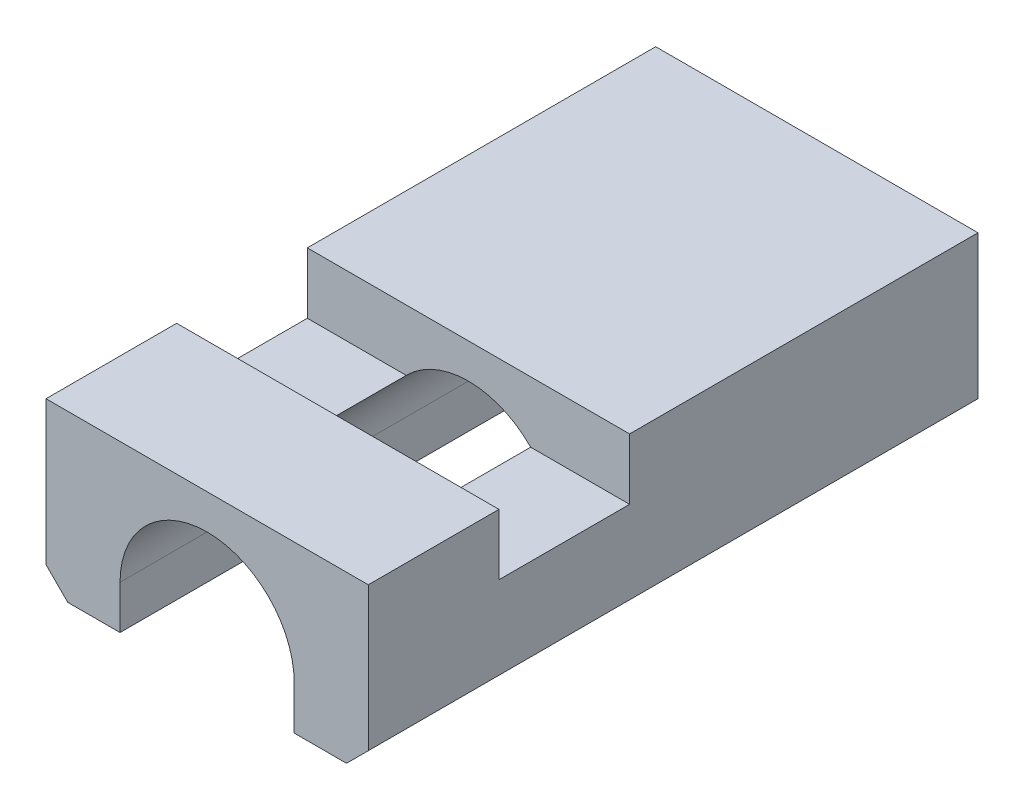
ISO-10303-21;
HEADER;
FILE_DESCRIPTION(('STEP AP214'),'2;1');
FILE_NAME('part.step','',(''),(''),'','','');
FILE_SCHEMA(('AUTOMOTIVE_DESIGN { 1 0 10303 214 1 1 1 1 }'));
ENDSEC;
DATA;
#1=APPLICATION_CONTEXT('core data for automotive mechanical design processes');
#2=APPLICATION_PROTOCOL_DEFINITION('international standard','automotive_design',2000,#1);
#3=PRODUCT_CONTEXT('',#1,'mechanical');
#4=PRODUCT('Part','Part','',(#3));
#5=PRODUCT_RELATED_PRODUCT_CATEGORY('part','',(#4));
#6=PRODUCT_DEFINITION_FORMATION('','',#4);
#7=PRODUCT_DEFINITION_CONTEXT('part definition',#1,'design');
#8=PRODUCT_DEFINITION('design','',#6,#7);
#9=PRODUCT_DEFINITION_SHAPE('','',#8);
#10=(LENGTH_UNIT() NAMED_UNIT(*) SI_UNIT(.MILLI.,.METRE.));
#11=(NAMED_UNIT(*) PLANE_ANGLE_UNIT() SI_UNIT($,.RADIAN.));
#12=(NAMED_UNIT(*) SI_UNIT($,.STERADIAN.) SOLID_ANGLE_UNIT());
#13=UNCERTAINTY_MEASURE_WITH_UNIT(LENGTH_MEASURE(1.E-05),#10,'distance_accuracy_value','');
#14=(GEOMETRIC_REPRESENTATION_CONTEXT(3) GLOBAL_UNCERTAINTY_ASSIGNED_CONTEXT((#13)) GLOBAL_UNIT_ASSIGNED_CONTEXT((#10,
#11,#12)) REPRESENTATION_CONTEXT('',''));
#15=CARTESIAN_POINT('',(0.,0.,0.));
#16=DIRECTION('',(0.,0.,1.));
#17=DIRECTION('',(1.,0.,0.));
#18=AXIS2_PLACEMENT_3D('',#15,#16,#17);
#19=CARTESIAN_POINT('',(-26.8712793989192,56.5488788418552,14.));
#20=DIRECTION('',(0.,-1.,0.));
#21=DIRECTION('',(0.,0.,-1.));
#22=AXIS2_PLACEMENT_3D('',#19,#20,#21);
#23=PLANE('',#22);
#24=DIRECTION('',(0.,0.,-1.));
#25=VECTOR('',#24,1.);
#26=CARTESIAN_POINT('',(-19.4712793989192,56.5488788418552,14.));
#27=LINE('',#26,#25);
#28=CARTESIAN_POINT('',(-19.4712793989192,56.5488788418552,14.));
#29=VERTEX_POINT('',#28);
#30=CARTESIAN_POINT('',(-19.4712793989192,56.5488788418552,11.));
#31=VERTEX_POINT('',#30);
#32=EDGE_CURVE('E237',#29,#31,#27,.T.);
#33=ORIENTED_EDGE('',*,*,#32,.T.);
#34=DIRECTION('',(1.,0.,0.));
#35=VECTOR('',#34,1.);
#36=CARTESIAN_POINT('',(-34.4712793989192,56.5488788418552,11.));
#37=LINE('',#36,#35);
#38=CARTESIAN_POINT('',(-26.8712793989192,56.5488788418552,11.));
#39=VERTEX_POINT('',#38);
#40=EDGE_CURVE('E165',#39,#31,#37,.T.);
#41=ORIENTED_EDGE('',*,*,#40,.F.);
#42=DIRECTION('',(0.,0.,-1.));
#43=VECTOR('',#42,1.);
#44=CARTESIAN_POINT('',(-26.8712793989192,56.5488788418552,14.));
#45=LINE('',#44,#43);
#46=CARTESIAN_POINT('',(-26.8712793989192,56.5488788418552,14.));
#47=VERTEX_POINT('',#46);
#48=EDGE_CURVE('E233',#47,#39,#45,.T.);
#49=ORIENTED_EDGE('',*,*,#48,.F.);
#50=DIRECTION('',(-1.,0.,0.));
#51=VECTOR('',#50,1.);
#52=CARTESIAN_POINT('',(-26.8712793989192,56.5488788418552,14.));
#53=LINE('',#52,#51);
#54=EDGE_CURVE('E203',#29,#47,#53,.T.);
#55=ORIENTED_EDGE('',*,*,#54,.F.);
#56=EDGE_LOOP('',(#33,#41,#49,#55));
#57=FACE_BOUND('',#56,.T.);
#58=ADVANCED_FACE('F35',(#57),#23,.F.);
#59=CARTESIAN_POINT('',(-25.1712793989192,52.7488788418552,14.));
#60=DIRECTION('',(-1.,0.,0.));
#61=DIRECTION('',(0.,-1.,0.));
#62=AXIS2_PLACEMENT_3D('',#59,#60,#61);
#63=PLANE('',#62);
#64=DIRECTION('',(0.,1.,0.));
#65=VECTOR('',#64,1.);
#66=CARTESIAN_POINT('',(-25.1712793989192,52.7488788418552,0.));
#67=LINE('',#66,#65);
#68=CARTESIAN_POINT('',(-25.1712793989192,52.7488788418552,0.));
#69=VERTEX_POINT('',#68);
#70=CARTESIAN_POINT('',(-25.1712793989192,53.7488788418552,0.));
#71=VERTEX_POINT('',#70);
#72=EDGE_CURVE('E189',#69,#71,#67,.T.);
#73=ORIENTED_EDGE('',*,*,#72,.T.);
#74=DIRECTION('',(0.,0.,-1.));
#75=VECTOR('',#74,1.);
#76=CARTESIAN_POINT('',(-25.1712793989192,53.7488788418552,14.));
#77=LINE('',#76,#75);
#78=CARTESIAN_POINT('',(-25.1712793989192,53.7488788418552,14.));
#79=VERTEX_POINT('',#78);
#80=EDGE_CURVE('E245',#79,#71,#77,.T.);
#81=ORIENTED_EDGE('',*,*,#80,.F.);
#82=DIRECTION('',(0.,1.,0.));
#83=VECTOR('',#82,1.);
#84=CARTESIAN_POINT('',(-25.1712793989192,52.7488788418552,14.));
#85=LINE('',#84,#83);
#86=CARTESIAN_POINT('',(-25.1712793989192,52.7488788418552,14.));
#87=VERTEX_POINT('',#86);
#88=EDGE_CURVE('E190',#87,#79,#85,.T.);
#89=ORIENTED_EDGE('',*,*,#88,.F.);
#90=DIRECTION('',(0.,0.,-1.));
#91=VECTOR('',#90,1.);
#92=CARTESIAN_POINT('',(-25.1712793989192,52.7488788418552,14.));
#93=LINE('',#92,#91);
#94=EDGE_CURVE('E210',#87,#69,#93,.T.);
#95=ORIENTED_EDGE('',*,*,#94,.T.);
#96=EDGE_LOOP('',(#73,#81,#89,#95));
#97=FACE_BOUND('',#96,.T.);
#98=ADVANCED_FACE('F296',(#97),#63,.F.);
#99=CARTESIAN_POINT('',(-23.1712793989192,53.7488788418552,14.));
#100=DIRECTION('',(0.,0.,-1.));
#101=DIRECTION('',(-1.,0.,0.));
#102=AXIS2_PLACEMENT_3D('',#99,#100,#101);
#103=CYLINDRICAL_SURFACE('',#102,2.);
#104=CARTESIAN_POINT('',(-23.1712793989192,53.7488788418552,8.));
#105=DIRECTION('',(0.,0.,-1.));
#106=DIRECTION('',(-1.,0.,0.));
#107=AXIS2_PLACEMENT_3D('',#104,#105,#106);
#108=CIRCLE('',#107,2.);
#109=CARTESIAN_POINT('',(-21.7429937132106,55.1488788418552,8.));
#110=VERTEX_POINT('',#109);
#111=CARTESIAN_POINT('',(-24.5995650846278,55.1488788418552,8.));
#112=VERTEX_POINT('',#111);
#113=EDGE_CURVE('E184',#110,#112,#108,.F.);
#114=ORIENTED_EDGE('',*,*,#113,.T.);
#115=DIRECTION('',(0.,0.,-1.));
#116=VECTOR('',#115,1.);
#117=CARTESIAN_POINT('',(-24.5995650846278,55.1488788418552,14.));
#118=LINE('',#117,#116);
#119=CARTESIAN_POINT('',(-24.5995650846278,55.1488788418552,11.));
#120=VERTEX_POINT('',#119);
#121=EDGE_CURVE('E181',#112,#120,#118,.F.);
#122=ORIENTED_EDGE('',*,*,#121,.T.);
#123=CARTESIAN_POINT('',(-23.1712793989192,53.7488788418552,11.));
#124=DIRECTION('',(0.,0.,1.));
#125=DIRECTION('',(0.,-1.,0.));
#126=AXIS2_PLACEMENT_3D('',#123,#124,#125);
#127=CIRCLE('',#126,2.);
#128=CARTESIAN_POINT('',(-21.7429937132106,55.1488788418552,11.));
#129=VERTEX_POINT('',#128);
#130=EDGE_CURVE('E187',#120,#129,#127,.F.);
#131=ORIENTED_EDGE('',*,*,#130,.T.);
#132=DIRECTION('',(0.,0.,-1.));
#133=VECTOR('',#132,1.);
#134=CARTESIAN_POINT('',(-21.7429937132106,55.1488788418552,14.));
#135=LINE('',#134,#133);
#136=EDGE_CURVE('E154',#129,#110,#135,.T.);
#137=ORIENTED_EDGE('',*,*,#136,.T.);
#138=EDGE_LOOP('',(#114,#122,#131,#137));
#139=FACE_BOUND('',#138,.T.);
#140=CARTESIAN_POINT('',(-23.1712793989192,53.7488788418552,0.));
#141=DIRECTION('',(0.,0.,-1.));
#142=DIRECTION('',(-1.,0.,0.));
#143=AXIS2_PLACEMENT_3D('',#140,#141,#142);
#144=CIRCLE('',#143,2.);
#145=CARTESIAN_POINT('',(-21.1712793989192,53.7488788418552,0.));
#146=VERTEX_POINT('',#145);
#147=EDGE_CURVE('E213',#71,#146,#144,.T.);
#148=ORIENTED_EDGE('',*,*,#147,.T.);
#149=DIRECTION('',(0.,0.,-1.));
#150=VECTOR('',#149,1.);
#151=CARTESIAN_POINT('',(-21.1712793989192,53.7488788418552,14.));
#152=LINE('',#151,#150);
#153=CARTESIAN_POINT('',(-21.1712793989192,53.7488788418552,14.));
#154=VERTEX_POINT('',#153);
#155=EDGE_CURVE('E242',#154,#146,#152,.T.);
#156=ORIENTED_EDGE('',*,*,#155,.F.);
#157=CARTESIAN_POINT('',(-23.1712793989192,53.7488788418552,14.));
#158=DIRECTION('',(0.,0.,-1.));
#159=DIRECTION('',(-1.,0.,0.));
#160=AXIS2_PLACEMENT_3D('',#157,#158,#159);
#161=CIRCLE('',#160,2.);
#162=EDGE_CURVE('E193',#79,#154,#161,.T.);
#163=ORIENTED_EDGE('',*,*,#162,.F.);
#164=ORIENTED_EDGE('',*,*,#80,.T.);
#165=EDGE_LOOP('',(#148,#156,#163,#164));
#166=FACE_BOUND('',#165,.T.);
#167=ADVANCED_FACE('F301',(#139,#166),#103,.F.);
#168=CARTESIAN_POINT('',(-21.1712793989192,53.7488788418552,14.));
#169=DIRECTION('',(1.,0.,0.));
#170=DIRECTION('',(0.,1.,0.));
#171=AXIS2_PLACEMENT_3D('',#168,#169,#170);
#172=PLANE('',#171);
#173=DIRECTION('',(0.,-1.,0.));
#174=VECTOR('',#173,1.);
#175=CARTESIAN_POINT('',(-21.1712793989192,53.7488788418552,0.));
#176=LINE('',#175,#174);
#177=CARTESIAN_POINT('',(-21.1712793989192,52.7488788418552,0.));
#178=VERTEX_POINT('',#177);
#179=EDGE_CURVE('E215',#146,#178,#176,.T.);
#180=ORIENTED_EDGE('',*,*,#179,.T.);
#181=DIRECTION('',(0.,0.,-1.));
#182=VECTOR('',#181,1.);
#183=CARTESIAN_POINT('',(-21.1712793989192,52.7488788418552,14.));
#184=LINE('',#183,#182);
#185=CARTESIAN_POINT('',(-21.1712793989192,52.7488788418552,14.));
#186=VERTEX_POINT('',#185);
#187=EDGE_CURVE('E239',#186,#178,#184,.T.);
#188=ORIENTED_EDGE('',*,*,#187,.F.);
#189=DIRECTION('',(0.,-1.,0.));
#190=VECTOR('',#189,1.);
#191=CARTESIAN_POINT('',(-21.1712793989192,53.7488788418552,14.));
#192=LINE('',#191,#190);
#193=EDGE_CURVE('E196',#154,#186,#192,.T.);
#194=ORIENTED_EDGE('',*,*,#193,.F.);
#195=ORIENTED_EDGE('',*,*,#155,.T.);
#196=EDGE_LOOP('',(#180,#188,#194,#195));
#197=FACE_BOUND('',#196,.T.);
#198=ADVANCED_FACE('F304',(#197),#172,.F.);
#199=CARTESIAN_POINT('',(-21.1712793989192,52.7488788418552,14.));
#200=DIRECTION('',(0.,1.,0.));
#201=DIRECTION('',(-1.,0.,0.));
#202=AXIS2_PLACEMENT_3D('',#199,#200,#201);
#203=PLANE('',#202);
#204=DIRECTION('',(1.,0.,0.));
#205=VECTOR('',#204,1.);
#206=CARTESIAN_POINT('',(-21.1712793989192,52.7488788418552,0.));
#207=LINE('',#206,#205);
#208=CARTESIAN_POINT('',(-19.9712793989192,52.7488788418552,0.));
#209=VERTEX_POINT('',#208);
#210=EDGE_CURVE('E217',#178,#209,#207,.T.);
#211=ORIENTED_EDGE('',*,*,#210,.T.);
#212=DIRECTION('',(0.,0.,1.));
#213=VECTOR('',#212,1.);
#214=CARTESIAN_POINT('',(-19.9712793989192,52.7488788418552,14.));
#215=LINE('',#214,#213);
#216=CARTESIAN_POINT('',(-19.9712793989192,52.7488788418552,14.));
#217=VERTEX_POINT('',#216);
#218=EDGE_CURVE('E255',#209,#217,#215,.T.);
#219=ORIENTED_EDGE('',*,*,#218,.T.);
#220=DIRECTION('',(1.,0.,0.));
#221=VECTOR('',#220,1.);
#222=CARTESIAN_POINT('',(-21.1712793989192,52.7488788418552,14.));
#223=LINE('',#222,#221);
#224=EDGE_CURVE('E198',#186,#217,#223,.T.);
#225=ORIENTED_EDGE('',*,*,#224,.F.);
#226=ORIENTED_EDGE('',*,*,#187,.T.);
#227=EDGE_LOOP('',(#211,#219,#225,#226));
#228=FACE_BOUND('',#227,.T.);
#229=ADVANCED_FACE('F308',(#228),#203,.F.);
#230=CARTESIAN_POINT('',(-19.4712793989192,53.7488788418552,14.));
#231=DIRECTION('',(-1.,0.,0.));
#232=DIRECTION('',(0.,0.,1.));
#233=AXIS2_PLACEMENT_3D('',#230,#231,#232);
#234=PLANE('',#233);
#235=DIRECTION('',(0.,0.,-1.));
#236=VECTOR('',#235,1.);
#237=CARTESIAN_POINT('',(-19.4712793989192,55.1488788418552,11.));
#238=LINE('',#237,#236);
#239=CARTESIAN_POINT('',(-19.4712793989192,55.1488788418552,11.));
#240=VERTEX_POINT('',#239);
#241=CARTESIAN_POINT('',(-19.4712793989192,55.1488788418552,8.));
#242=VERTEX_POINT('',#241);
#243=EDGE_CURVE('E151',#240,#242,#238,.T.);
#244=ORIENTED_EDGE('',*,*,#243,.F.);
#245=DIRECTION('',(0.,-1.,0.));
#246=VECTOR('',#245,1.);
#247=CARTESIAN_POINT('',(-19.4712793989192,56.5488788418552,11.));
#248=LINE('',#247,#246);
#249=EDGE_CURVE('E161',#31,#240,#248,.T.);
#250=ORIENTED_EDGE('',*,*,#249,.F.);
#251=ORIENTED_EDGE('',*,*,#32,.F.);
#252=DIRECTION('',(0.,1.,0.));
#253=VECTOR('',#252,1.);
#254=CARTESIAN_POINT('',(-19.4712793989192,52.7488788418552,14.));
#255=LINE('',#254,#253);
#256=CARTESIAN_POINT('',(-19.4712793989192,53.2488788418552,14.));
#257=VERTEX_POINT('',#256);
#258=EDGE_CURVE('E201',#257,#29,#255,.T.);
#259=ORIENTED_EDGE('',*,*,#258,.F.);
#260=DIRECTION('',(0.,0.,-1.));
#261=VECTOR('',#260,1.);
#262=CARTESIAN_POINT('',(-19.4712793989192,53.2488788418552,14.));
#263=LINE('',#262,#261);
#264=CARTESIAN_POINT('',(-19.4712793989192,53.2488788418552,0.));
#265=VERTEX_POINT('',#264);
#266=EDGE_CURVE('E248',#257,#265,#263,.T.);
#267=ORIENTED_EDGE('',*,*,#266,.T.);
#268=DIRECTION('',(0.,1.,0.));
#269=VECTOR('',#268,1.);
#270=CARTESIAN_POINT('',(-19.4712793989192,53.7488788418552,0.));
#271=LINE('',#270,#269);
#272=CARTESIAN_POINT('',(-19.4712793989192,56.5488788418552,0.));
#273=VERTEX_POINT('',#272);
#274=EDGE_CURVE('E220',#265,#273,#271,.T.);
#275=ORIENTED_EDGE('',*,*,#274,.T.);
#276=CARTESIAN_POINT('',(-19.4712793989192,56.5488788418552,8.));
#277=VERTEX_POINT('',#276);
#278=EDGE_CURVE('E236',#277,#273,#27,.T.);
#279=ORIENTED_EDGE('',*,*,#278,.F.);
#280=DIRECTION('',(0.,1.,0.));
#281=VECTOR('',#280,1.);
#282=CARTESIAN_POINT('',(-19.4712793989192,56.5488788418552,8.));
#283=LINE('',#282,#281);
#284=EDGE_CURVE('E158',#242,#277,#283,.T.);
#285=ORIENTED_EDGE('',*,*,#284,.F.);
#286=EDGE_LOOP('',(#244,#250,#251,#259,#267,#275,#279,#285));
#287=FACE_BOUND('',#286,.T.);
#288=ADVANCED_FACE('F170',(#287),#234,.F.);
#289=CARTESIAN_POINT('',(-26.8712793989192,56.5488788418552,8.));
#290=VERTEX_POINT('',#289);
#291=CARTESIAN_POINT('',(-26.8712793989192,56.5488788418552,0.));
#292=VERTEX_POINT('',#291);
#293=EDGE_CURVE('E232',#290,#292,#45,.T.);
#294=ORIENTED_EDGE('',*,*,#293,.F.);
#295=DIRECTION('',(1.,0.,0.));
#296=VECTOR('',#295,1.);
#297=CARTESIAN_POINT('',(-34.4712793989192,56.5488788418552,8.));
#298=LINE('',#297,#296);
#299=EDGE_CURVE('E176',#290,#277,#298,.T.);
#300=ORIENTED_EDGE('',*,*,#299,.T.);
#301=ORIENTED_EDGE('',*,*,#278,.T.);
#302=DIRECTION('',(-1.,0.,0.));
#303=VECTOR('',#302,1.);
#304=CARTESIAN_POINT('',(-26.8712793989192,56.5488788418552,0.));
#305=LINE('',#304,#303);
#306=EDGE_CURVE('E223',#273,#292,#305,.T.);
#307=ORIENTED_EDGE('',*,*,#306,.T.);
#308=EDGE_LOOP('',(#294,#300,#301,#307));
#309=FACE_BOUND('',#308,.T.);
#310=ADVANCED_FACE('F275',(#309),#23,.F.);
#311=CARTESIAN_POINT('',(-26.8712793989192,53.7488788418552,14.));
#312=DIRECTION('',(1.,0.,0.));
#313=DIRECTION('',(0.,0.,-1.));
#314=AXIS2_PLACEMENT_3D('',#311,#312,#313);
#315=PLANE('',#314);
#316=ORIENTED_EDGE('',*,*,#48,.T.);
#317=DIRECTION('',(0.,-1.,0.));
#318=VECTOR('',#317,1.);
#319=CARTESIAN_POINT('',(-26.8712793989192,53.7488788418552,11.));
#320=LINE('',#319,#318);
#321=CARTESIAN_POINT('',(-26.8712793989192,55.1488788418552,11.));
#322=VERTEX_POINT('',#321);
#323=EDGE_CURVE('E11',#39,#322,#320,.T.);
#324=ORIENTED_EDGE('',*,*,#323,.T.);
#325=DIRECTION('',(0.,0.,-1.));
#326=VECTOR('',#325,1.);
#327=CARTESIAN_POINT('',(-26.8712793989192,55.1488788418552,14.));
#328=LINE('',#327,#326);
#329=CARTESIAN_POINT('',(-26.8712793989192,55.1488788418552,8.));
#330=VERTEX_POINT('',#329);
#331=EDGE_CURVE('E266',#322,#330,#328,.T.);
#332=ORIENTED_EDGE('',*,*,#331,.T.);
#333=DIRECTION('',(0.,1.,0.));
#334=VECTOR('',#333,1.);
#335=CARTESIAN_POINT('',(-26.8712793989192,53.7488788418552,8.));
#336=LINE('',#335,#334);
#337=EDGE_CURVE('E44',#330,#290,#336,.T.);
#338=ORIENTED_EDGE('',*,*,#337,.T.);
#339=ORIENTED_EDGE('',*,*,#293,.T.);
#340=DIRECTION('',(0.,-1.,0.));
#341=VECTOR('',#340,1.);
#342=CARTESIAN_POINT('',(-26.8712793989192,53.7488788418552,0.));
#343=LINE('',#342,#341);
#344=CARTESIAN_POINT('',(-26.8712793989192,53.2488788418552,0.));
#345=VERTEX_POINT('',#344);
#346=EDGE_CURVE('E226',#292,#345,#343,.T.);
#347=ORIENTED_EDGE('',*,*,#346,.T.);
#348=DIRECTION('',(0.,0.,1.));
#349=VECTOR('',#348,1.);
#350=CARTESIAN_POINT('',(-26.8712793989192,53.2488788418552,14.));
#351=LINE('',#350,#349);
#352=CARTESIAN_POINT('',(-26.8712793989192,53.2488788418552,14.));
#353=VERTEX_POINT('',#352);
#354=EDGE_CURVE('E264',#345,#353,#351,.T.);
#355=ORIENTED_EDGE('',*,*,#354,.T.);
#356=DIRECTION('',(0.,-1.,0.));
#357=VECTOR('',#356,1.);
#358=CARTESIAN_POINT('',(-26.8712793989192,53.7488788418552,14.));
#359=LINE('',#358,#357);
#360=EDGE_CURVE('E205',#47,#353,#359,.T.);
#361=ORIENTED_EDGE('',*,*,#360,.F.);
#362=EDGE_LOOP('',(#316,#324,#332,#338,#339,#347,#355,#361));
#363=FACE_BOUND('',#362,.T.);
#364=ADVANCED_FACE('F271',(#363),#315,.F.);
#365=CARTESIAN_POINT('',(-26.8712793989192,52.7488788418552,14.));
#366=DIRECTION('',(0.,1.,0.));
#367=DIRECTION('',(0.,0.,1.));
#368=AXIS2_PLACEMENT_3D('',#365,#366,#367);
#369=PLANE('',#368);
#370=DIRECTION('',(1.,0.,0.));
#371=VECTOR('',#370,1.);
#372=CARTESIAN_POINT('',(-26.8712793989192,52.7488788418552,14.));
#373=LINE('',#372,#371);
#374=CARTESIAN_POINT('',(-26.3712793989192,52.7488788418552,14.));
#375=VERTEX_POINT('',#374);
#376=EDGE_CURVE('E208',#375,#87,#373,.T.);
#377=ORIENTED_EDGE('',*,*,#376,.F.);
#378=DIRECTION('',(0.,0.,-1.));
#379=VECTOR('',#378,1.);
#380=CARTESIAN_POINT('',(-26.3712793989192,52.7488788418552,14.));
#381=LINE('',#380,#379);
#382=CARTESIAN_POINT('',(-26.3712793989192,52.7488788418552,0.));
#383=VERTEX_POINT('',#382);
#384=EDGE_CURVE('E261',#375,#383,#381,.T.);
#385=ORIENTED_EDGE('',*,*,#384,.T.);
#386=DIRECTION('',(1.,0.,0.));
#387=VECTOR('',#386,1.);
#388=CARTESIAN_POINT('',(-26.8712793989192,52.7488788418552,0.));
#389=LINE('',#388,#387);
#390=EDGE_CURVE('E194',#383,#69,#389,.T.);
#391=ORIENTED_EDGE('',*,*,#390,.T.);
#392=ORIENTED_EDGE('',*,*,#94,.F.);
#393=EDGE_LOOP('',(#377,#385,#391,#392));
#394=FACE_BOUND('',#393,.T.);
#395=ADVANCED_FACE('F291',(#394),#369,.F.);
#396=CARTESIAN_POINT('',(-23.1712793989192,53.7488788418552,14.));
#397=DIRECTION('',(0.,0.,-1.));
#398=DIRECTION('',(-1.,0.,0.));
#399=AXIS2_PLACEMENT_3D('',#396,#397,#398);
#400=PLANE('',#399);
#401=ORIENTED_EDGE('',*,*,#224,.T.);
#402=DIRECTION('',(-0.707106781186545,-0.70710678118655,0.));
#403=VECTOR('',#402,1.);
#404=CARTESIAN_POINT('',(-19.4712793989192,53.2488788418552,14.));
#405=LINE('',#404,#403);
#406=EDGE_CURVE('E259',#217,#257,#405,.F.);
#407=ORIENTED_EDGE('',*,*,#406,.T.);
#408=ORIENTED_EDGE('',*,*,#258,.T.);
#409=ORIENTED_EDGE('',*,*,#54,.T.);
#410=ORIENTED_EDGE('',*,*,#360,.T.);
#411=DIRECTION('',(-0.707106781186543,0.707106781186552,0.));
#412=VECTOR('',#411,1.);
#413=CARTESIAN_POINT('',(-26.3712793989192,52.7488788418552,14.));
#414=LINE('',#413,#412);
#415=EDGE_CURVE('E257',#353,#375,#414,.F.);
#416=ORIENTED_EDGE('',*,*,#415,.T.);
#417=ORIENTED_EDGE('',*,*,#376,.T.);
#418=ORIENTED_EDGE('',*,*,#88,.T.);
#419=ORIENTED_EDGE('',*,*,#162,.T.);
#420=ORIENTED_EDGE('',*,*,#193,.T.);
#421=EDGE_LOOP('',(#401,#407,#408,#409,#410,#416,#417,#418,#419,#420));
#422=FACE_BOUND('',#421,.T.);
#423=ADVANCED_FACE('F288',(#422),#400,.F.);
#424=CARTESIAN_POINT('',(-23.1712793989192,53.7488788418552,0.));
#425=DIRECTION('',(0.,0.,-1.));
#426=DIRECTION('',(-1.,0.,0.));
#427=AXIS2_PLACEMENT_3D('',#424,#425,#426);
#428=PLANE('',#427);
#429=ORIENTED_EDGE('',*,*,#274,.F.);
#430=DIRECTION('',(0.707106781186545,0.70710678118655,0.));
#431=VECTOR('',#430,1.);
#432=CARTESIAN_POINT('',(-21.0712793989192,51.6488788418552,0.));
#433=LINE('',#432,#431);
#434=EDGE_CURVE('E253',#265,#209,#433,.F.);
#435=ORIENTED_EDGE('',*,*,#434,.T.);
#436=ORIENTED_EDGE('',*,*,#210,.F.);
#437=ORIENTED_EDGE('',*,*,#179,.F.);
#438=ORIENTED_EDGE('',*,*,#147,.F.);
#439=ORIENTED_EDGE('',*,*,#72,.F.);
#440=ORIENTED_EDGE('',*,*,#390,.F.);
#441=DIRECTION('',(0.707106781186543,-0.707106781186552,0.));
#442=VECTOR('',#441,1.);
#443=CARTESIAN_POINT('',(-25.2712793989192,51.6488788418552,0.));
#444=LINE('',#443,#442);
#445=EDGE_CURVE('E251',#383,#345,#444,.F.);
#446=ORIENTED_EDGE('',*,*,#445,.T.);
#447=ORIENTED_EDGE('',*,*,#346,.F.);
#448=ORIENTED_EDGE('',*,*,#306,.F.);
#449=EDGE_LOOP('',(#429,#435,#436,#437,#438,#439,#440,#446,#447,#448));
#450=FACE_BOUND('',#449,.T.);
#451=ADVANCED_FACE('F279',(#450),#428,.T.);
#452=CARTESIAN_POINT('',(-19.4712793989192,53.2488788418552,14.));
#453=DIRECTION('',(-0.70710678118655,0.707106781186545,0.));
#454=DIRECTION('',(0.,0.,-1.));
#455=AXIS2_PLACEMENT_3D('',#452,#453,#454);
#456=PLANE('',#455);
#457=ORIENTED_EDGE('',*,*,#406,.F.);
#458=ORIENTED_EDGE('',*,*,#218,.F.);
#459=ORIENTED_EDGE('',*,*,#434,.F.);
#460=ORIENTED_EDGE('',*,*,#266,.F.);
#461=EDGE_LOOP('',(#457,#458,#459,#460));
#462=FACE_BOUND('',#461,.T.);
#463=ADVANCED_FACE('F314',(#462),#456,.F.);
#464=CARTESIAN_POINT('',(-26.3712793989192,52.7488788418552,14.));
#465=DIRECTION('',(0.707106781186552,0.707106781186543,0.));
#466=DIRECTION('',(0.,0.,-1.));
#467=AXIS2_PLACEMENT_3D('',#464,#465,#466);
#468=PLANE('',#467);
#469=ORIENTED_EDGE('',*,*,#415,.F.);
#470=ORIENTED_EDGE('',*,*,#354,.F.);
#471=ORIENTED_EDGE('',*,*,#445,.F.);
#472=ORIENTED_EDGE('',*,*,#384,.F.);
#473=EDGE_LOOP('',(#469,#470,#471,#472));
#474=FACE_BOUND('',#473,.T.);
#475=ADVANCED_FACE('F38',(#474),#468,.F.);
#476=CARTESIAN_POINT('',(-34.4712793989192,56.5488788418552,11.));
#477=DIRECTION('',(0.,0.,1.));
#478=DIRECTION('',(0.,-1.,0.));
#479=AXIS2_PLACEMENT_3D('',#476,#477,#478);
#480=PLANE('',#479);
#481=DIRECTION('',(1.,0.,0.));
#482=VECTOR('',#481,1.);
#483=CARTESIAN_POINT('',(-34.4712793989192,55.1488788418552,11.));
#484=LINE('',#483,#482);
#485=EDGE_CURVE('E157',#322,#120,#484,.T.);
#486=ORIENTED_EDGE('',*,*,#485,.F.);
#487=ORIENTED_EDGE('',*,*,#323,.F.);
#488=ORIENTED_EDGE('',*,*,#40,.T.);
#489=ORIENTED_EDGE('',*,*,#249,.T.);
#490=EDGE_CURVE('E147',#129,#240,#484,.T.);
#491=ORIENTED_EDGE('',*,*,#490,.F.);
#492=ORIENTED_EDGE('',*,*,#130,.F.);
#493=EDGE_LOOP('',(#486,#487,#488,#489,#491,#492));
#494=FACE_BOUND('',#493,.T.);
#495=ADVANCED_FACE('F163',(#494),#480,.F.);
#496=CARTESIAN_POINT('',(-34.4712793989192,56.5488788418552,8.));
#497=DIRECTION('',(0.,0.,-1.));
#498=DIRECTION('',(-1.,0.,0.));
#499=AXIS2_PLACEMENT_3D('',#496,#497,#498);
#500=PLANE('',#499);
#501=DIRECTION('',(1.,0.,0.));
#502=VECTOR('',#501,1.);
#503=CARTESIAN_POINT('',(-34.4712793989192,55.1488788418552,8.));
#504=LINE('',#503,#502);
#505=EDGE_CURVE('E51',#110,#242,#504,.T.);
#506=ORIENTED_EDGE('',*,*,#505,.T.);
#507=ORIENTED_EDGE('',*,*,#284,.T.);
#508=ORIENTED_EDGE('',*,*,#299,.F.);
#509=ORIENTED_EDGE('',*,*,#337,.F.);
#510=EDGE_CURVE('E59',#330,#112,#504,.T.);
#511=ORIENTED_EDGE('',*,*,#510,.T.);
#512=ORIENTED_EDGE('',*,*,#113,.F.);
#513=EDGE_LOOP('',(#506,#507,#508,#509,#511,#512));
#514=FACE_BOUND('',#513,.T.);
#515=ADVANCED_FACE('F321',(#514),#500,.F.);
#516=CARTESIAN_POINT('',(-34.4712793989192,55.1488788418552,11.));
#517=DIRECTION('',(0.,-1.,0.));
#518=DIRECTION('',(0.,0.,-1.));
#519=AXIS2_PLACEMENT_3D('',#516,#517,#518);
#520=PLANE('',#519);
#521=ORIENTED_EDGE('',*,*,#510,.F.);
#522=ORIENTED_EDGE('',*,*,#331,.F.);
#523=ORIENTED_EDGE('',*,*,#485,.T.);
#524=ORIENTED_EDGE('',*,*,#121,.F.);
#525=EDGE_LOOP('',(#521,#522,#523,#524));
#526=FACE_BOUND('',#525,.T.);
#527=ADVANCED_FACE('F319',(#526),#520,.F.);
#528=ORIENTED_EDGE('',*,*,#490,.T.);
#529=ORIENTED_EDGE('',*,*,#243,.T.);
#530=ORIENTED_EDGE('',*,*,#505,.F.);
#531=ORIENTED_EDGE('',*,*,#136,.F.);
#532=EDGE_LOOP('',(#528,#529,#530,#531));
#533=FACE_BOUND('',#532,.T.);
#534=ADVANCED_FACE('F149',(#533),#520,.F.);
#535=CLOSED_SHELL('',(#58,#98,#167,#198,#229,#288,#310,#364,#395,#423,#451,#463,#475,#495,#515,
#527,#534));
#536=MANIFOLD_SOLID_BREP('B2',#535);
#537=ADVANCED_BREP_SHAPE_REPRESENTATION('',(#18,#536),#14);
#538=SHAPE_DEFINITION_REPRESENTATION(#9,#537);
ENDSEC;
END-ISO-10303-21;
